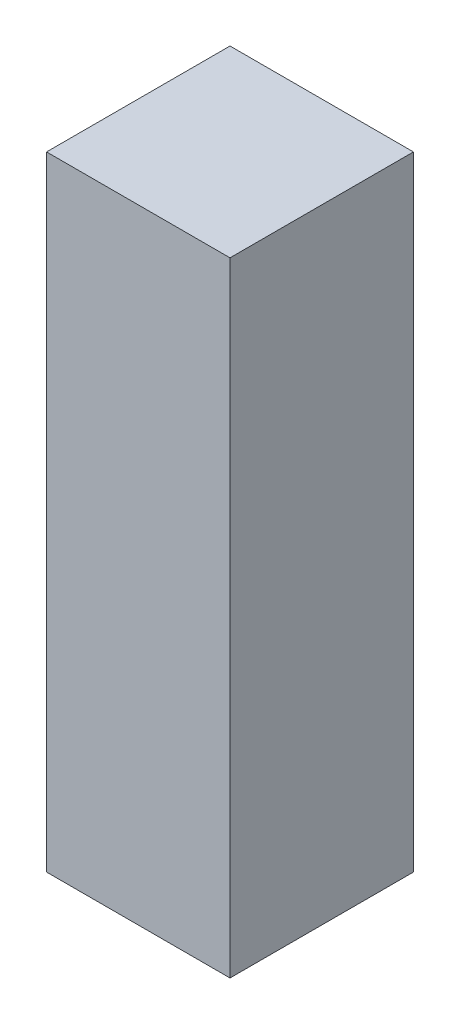
ISO-10303-21;
HEADER;
FILE_DESCRIPTION(('STEP AP214'),'2;1');
FILE_NAME('part.step','',(''),(''),'','','');
FILE_SCHEMA(('AUTOMOTIVE_DESIGN { 1 0 10303 214 1 1 1 1 }'));
ENDSEC;
DATA;
#1=APPLICATION_CONTEXT('core data for automotive mechanical design processes');
#2=APPLICATION_PROTOCOL_DEFINITION('international standard','automotive_design',2000,#1);
#3=PRODUCT_CONTEXT('',#1,'mechanical');
#4=PRODUCT('Part','Part','',(#3));
#5=PRODUCT_RELATED_PRODUCT_CATEGORY('part','',(#4));
#6=PRODUCT_DEFINITION_FORMATION('','',#4);
#7=PRODUCT_DEFINITION_CONTEXT('part definition',#1,'design');
#8=PRODUCT_DEFINITION('design','',#6,#7);
#9=PRODUCT_DEFINITION_SHAPE('','',#8);
#10=(LENGTH_UNIT() NAMED_UNIT(*) SI_UNIT(.MILLI.,.METRE.));
#11=(NAMED_UNIT(*) PLANE_ANGLE_UNIT() SI_UNIT($,.RADIAN.));
#12=(NAMED_UNIT(*) SI_UNIT($,.STERADIAN.) SOLID_ANGLE_UNIT());
#13=UNCERTAINTY_MEASURE_WITH_UNIT(LENGTH_MEASURE(1.E-05),#10,'distance_accuracy_value','');
#14=(GEOMETRIC_REPRESENTATION_CONTEXT(3) GLOBAL_UNCERTAINTY_ASSIGNED_CONTEXT((#13)) GLOBAL_UNIT_ASSIGNED_CONTEXT((#10,
#11,#12)) REPRESENTATION_CONTEXT('',''));
#15=CARTESIAN_POINT('',(0.,0.,0.));
#16=DIRECTION('',(0.,0.,1.));
#17=DIRECTION('',(1.,0.,0.));
#18=AXIS2_PLACEMENT_3D('',#15,#16,#17);
#19=CARTESIAN_POINT('',(0.25,0.85,0.25));
#20=DIRECTION('',(-1.,0.,0.));
#21=DIRECTION('',(0.,0.,1.));
#22=AXIS2_PLACEMENT_3D('',#19,#20,#21);
#23=PLANE('',#22);
#24=DIRECTION('',(0.,0.,-1.));
#25=VECTOR('',#24,1.);
#26=CARTESIAN_POINT('',(0.25,-0.85,0.25));
#27=LINE('',#26,#25);
#28=CARTESIAN_POINT('',(0.25,-0.85,0.25));
#29=VERTEX_POINT('',#28);
#30=CARTESIAN_POINT('',(0.25,-0.85,-0.25));
#31=VERTEX_POINT('',#30);
#32=EDGE_CURVE('E95',#29,#31,#27,.T.);
#33=ORIENTED_EDGE('',*,*,#32,.T.);
#34=DIRECTION('',(0.,-1.,0.));
#35=VECTOR('',#34,1.);
#36=CARTESIAN_POINT('',(0.25,0.85,-0.25));
#37=LINE('',#36,#35);
#38=CARTESIAN_POINT('',(0.25,0.85,-0.25));
#39=VERTEX_POINT('',#38);
#40=EDGE_CURVE('E11',#39,#31,#37,.T.);
#41=ORIENTED_EDGE('',*,*,#40,.F.);
#42=DIRECTION('',(0.,0.,-1.));
#43=VECTOR('',#42,1.);
#44=CARTESIAN_POINT('',(0.25,0.85,0.25));
#45=LINE('',#44,#43);
#46=CARTESIAN_POINT('',(0.25,0.85,0.25));
#47=VERTEX_POINT('',#46);
#48=EDGE_CURVE('E83',#47,#39,#45,.T.);
#49=ORIENTED_EDGE('',*,*,#48,.F.);
#50=DIRECTION('',(0.,-1.,0.));
#51=VECTOR('',#50,1.);
#52=CARTESIAN_POINT('',(0.25,0.85,0.25));
#53=LINE('',#52,#51);
#54=EDGE_CURVE('E91',#47,#29,#53,.T.);
#55=ORIENTED_EDGE('',*,*,#54,.T.);
#56=EDGE_LOOP('',(#33,#41,#49,#55));
#57=FACE_BOUND('',#56,.T.);
#58=ADVANCED_FACE('F32',(#57),#23,.F.);
#59=CARTESIAN_POINT('',(-0.25,0.85,-0.25));
#60=DIRECTION('',(0.,0.,1.));
#61=DIRECTION('',(1.,0.,0.));
#62=AXIS2_PLACEMENT_3D('',#59,#60,#61);
#63=PLANE('',#62);
#64=DIRECTION('',(-1.,0.,0.));
#65=VECTOR('',#64,1.);
#66=CARTESIAN_POINT('',(-0.25,-0.85,-0.25));
#67=LINE('',#66,#65);
#68=CARTESIAN_POINT('',(-0.25,-0.85,-0.25));
#69=VERTEX_POINT('',#68);
#70=EDGE_CURVE('E87',#31,#69,#67,.T.);
#71=ORIENTED_EDGE('',*,*,#70,.T.);
#72=DIRECTION('',(0.,-1.,0.));
#73=VECTOR('',#72,1.);
#74=CARTESIAN_POINT('',(-0.25,0.85,-0.25));
#75=LINE('',#74,#73);
#76=CARTESIAN_POINT('',(-0.25,0.85,-0.25));
#77=VERTEX_POINT('',#76);
#78=EDGE_CURVE('E40',#77,#69,#75,.T.);
#79=ORIENTED_EDGE('',*,*,#78,.F.);
#80=DIRECTION('',(-1.,0.,0.));
#81=VECTOR('',#80,1.);
#82=CARTESIAN_POINT('',(-0.25,0.85,-0.25));
#83=LINE('',#82,#81);
#84=EDGE_CURVE('E78',#39,#77,#83,.T.);
#85=ORIENTED_EDGE('',*,*,#84,.F.);
#86=ORIENTED_EDGE('',*,*,#40,.T.);
#87=EDGE_LOOP('',(#71,#79,#85,#86));
#88=FACE_BOUND('',#87,.T.);
#89=ADVANCED_FACE('F86',(#88),#63,.F.);
#90=CARTESIAN_POINT('',(-0.25,0.85,0.25));
#91=DIRECTION('',(1.,0.,0.));
#92=DIRECTION('',(0.,0.,-1.));
#93=AXIS2_PLACEMENT_3D('',#90,#91,#92);
#94=PLANE('',#93);
#95=DIRECTION('',(0.,0.,1.));
#96=VECTOR('',#95,1.);
#97=CARTESIAN_POINT('',(-0.25,-0.85,0.25));
#98=LINE('',#97,#96);
#99=CARTESIAN_POINT('',(-0.25,-0.85,0.25));
#100=VERTEX_POINT('',#99);
#101=EDGE_CURVE('E65',#69,#100,#98,.T.);
#102=ORIENTED_EDGE('',*,*,#101,.T.);
#103=DIRECTION('',(0.,-1.,0.));
#104=VECTOR('',#103,1.);
#105=CARTESIAN_POINT('',(-0.25,0.85,0.25));
#106=LINE('',#105,#104);
#107=CARTESIAN_POINT('',(-0.25,0.85,0.25));
#108=VERTEX_POINT('',#107);
#109=EDGE_CURVE('E88',#108,#100,#106,.T.);
#110=ORIENTED_EDGE('',*,*,#109,.F.);
#111=DIRECTION('',(0.,0.,1.));
#112=VECTOR('',#111,1.);
#113=CARTESIAN_POINT('',(-0.25,0.85,0.25));
#114=LINE('',#113,#112);
#115=EDGE_CURVE('E81',#77,#108,#114,.T.);
#116=ORIENTED_EDGE('',*,*,#115,.F.);
#117=ORIENTED_EDGE('',*,*,#78,.T.);
#118=EDGE_LOOP('',(#102,#110,#116,#117));
#119=FACE_BOUND('',#118,.T.);
#120=ADVANCED_FACE('F89',(#119),#94,.F.);
#121=CARTESIAN_POINT('',(-0.25,0.85,0.25));
#122=DIRECTION('',(0.,0.,-1.));
#123=DIRECTION('',(-1.,0.,0.));
#124=AXIS2_PLACEMENT_3D('',#121,#122,#123);
#125=PLANE('',#124);
#126=DIRECTION('',(1.,0.,0.));
#127=VECTOR('',#126,1.);
#128=CARTESIAN_POINT('',(-0.25,-0.85,0.25));
#129=LINE('',#128,#127);
#130=EDGE_CURVE('E71',#100,#29,#129,.T.);
#131=ORIENTED_EDGE('',*,*,#130,.T.);
#132=ORIENTED_EDGE('',*,*,#54,.F.);
#133=DIRECTION('',(1.,0.,0.));
#134=VECTOR('',#133,1.);
#135=CARTESIAN_POINT('',(-0.25,0.85,0.25));
#136=LINE('',#135,#134);
#137=EDGE_CURVE('E48',#108,#47,#136,.T.);
#138=ORIENTED_EDGE('',*,*,#137,.F.);
#139=ORIENTED_EDGE('',*,*,#109,.T.);
#140=EDGE_LOOP('',(#131,#132,#138,#139));
#141=FACE_BOUND('',#140,.T.);
#142=ADVANCED_FACE('F102',(#141),#125,.F.);
#143=CARTESIAN_POINT('',(0.,0.85,0.));
#144=DIRECTION('',(0.,-1.,0.));
#145=DIRECTION('',(0.,0.,-1.));
#146=AXIS2_PLACEMENT_3D('',#143,#144,#145);
#147=PLANE('',#146);
#148=ORIENTED_EDGE('',*,*,#48,.T.);
#149=ORIENTED_EDGE('',*,*,#84,.T.);
#150=ORIENTED_EDGE('',*,*,#115,.T.);
#151=ORIENTED_EDGE('',*,*,#137,.T.);
#152=EDGE_LOOP('',(#148,#149,#150,#151));
#153=FACE_BOUND('',#152,.T.);
#154=ADVANCED_FACE('F79',(#153),#147,.F.);
#155=CARTESIAN_POINT('',(0.,-0.85,0.));
#156=DIRECTION('',(0.,-1.,0.));
#157=DIRECTION('',(0.,0.,-1.));
#158=AXIS2_PLACEMENT_3D('',#155,#156,#157);
#159=PLANE('',#158);
#160=ORIENTED_EDGE('',*,*,#32,.F.);
#161=ORIENTED_EDGE('',*,*,#130,.F.);
#162=ORIENTED_EDGE('',*,*,#101,.F.);
#163=ORIENTED_EDGE('',*,*,#70,.F.);
#164=EDGE_LOOP('',(#160,#161,#162,#163));
#165=FACE_BOUND('',#164,.T.);
#166=ADVANCED_FACE('F105',(#165),#159,.T.);
#167=CLOSED_SHELL('',(#58,#89,#120,#142,#154,#166));
#168=MANIFOLD_SOLID_BREP('B2',#167);
#169=ADVANCED_BREP_SHAPE_REPRESENTATION('',(#18,#168),#14);
#170=SHAPE_DEFINITION_REPRESENTATION(#9,#169);
ENDSEC;
END-ISO-10303-21;
